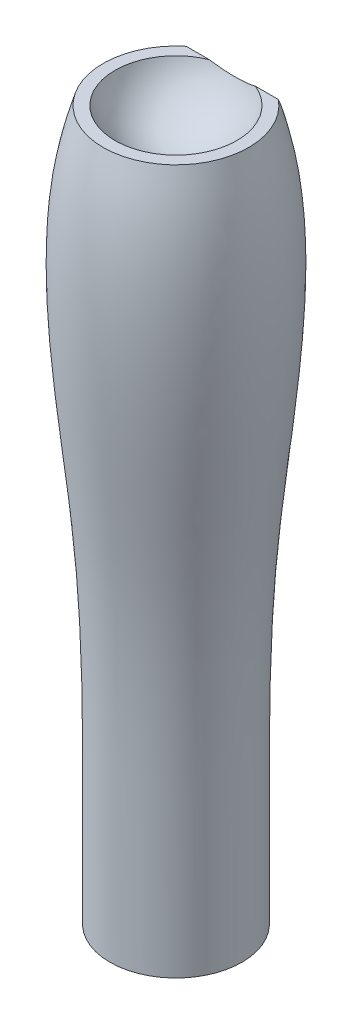
ISO-10303-21;
HEADER;
FILE_DESCRIPTION(('STEP AP214'),'2;1');
FILE_NAME('part.step','',(''),(''),'','','');
FILE_SCHEMA(('AUTOMOTIVE_DESIGN { 1 0 10303 214 1 1 1 1 }'));
ENDSEC;
DATA;
#1=APPLICATION_CONTEXT('core data for automotive mechanical design processes');
#2=APPLICATION_PROTOCOL_DEFINITION('international standard','automotive_design',2000,#1);
#3=PRODUCT_CONTEXT('',#1,'mechanical');
#4=PRODUCT('Part','Part','',(#3));
#5=PRODUCT_RELATED_PRODUCT_CATEGORY('part','',(#4));
#6=PRODUCT_DEFINITION_FORMATION('','',#4);
#7=PRODUCT_DEFINITION_CONTEXT('part definition',#1,'design');
#8=PRODUCT_DEFINITION('design','',#6,#7);
#9=PRODUCT_DEFINITION_SHAPE('','',#8);
#10=(LENGTH_UNIT() NAMED_UNIT(*) SI_UNIT(.MILLI.,.METRE.));
#11=(NAMED_UNIT(*) PLANE_ANGLE_UNIT() SI_UNIT($,.RADIAN.));
#12=(NAMED_UNIT(*) SI_UNIT($,.STERADIAN.) SOLID_ANGLE_UNIT());
#13=UNCERTAINTY_MEASURE_WITH_UNIT(LENGTH_MEASURE(1.E-05),#10,'distance_accuracy_value','');
#14=(GEOMETRIC_REPRESENTATION_CONTEXT(3) GLOBAL_UNCERTAINTY_ASSIGNED_CONTEXT((#13)) GLOBAL_UNIT_ASSIGNED_CONTEXT((#10,
#11,#12)) REPRESENTATION_CONTEXT('',''));
#15=CARTESIAN_POINT('',(0.,0.,0.));
#16=DIRECTION('',(0.,0.,1.));
#17=DIRECTION('',(1.,0.,0.));
#18=AXIS2_PLACEMENT_3D('',#15,#16,#17);
#19=CARTESIAN_POINT('',(-0.000457822219530569,-203.890571265797,-0.0541182311176803));
#20=DIRECTION('',(0.,1.,0.));
#21=DIRECTION('',(0.,0.,1.));
#22=AXIS2_PLACEMENT_3D('',#19,#20,#21);
#23=PLANE('',#22);
#24=CARTESIAN_POINT('',(-0.000457822219609983,-203.890571265797,-0.0541182311176803));
#25=DIRECTION('',(0.,1.,0.));
#26=DIRECTION('',(0.,0.,1.));
#27=AXIS2_PLACEMENT_3D('',#24,#25,#26);
#28=CIRCLE('',#27,34.6786200000001);
#29=CARTESIAN_POINT('',(-0.000457822219609983,-203.890571265797,34.6245017688824));
#30=VERTEX_POINT('',#29);
#31=EDGE_CURVE('E44',#30,#30,#28,.T.);
#32=ORIENTED_EDGE('',*,*,#31,.F.);
#33=EDGE_LOOP('',(#32));
#34=FACE_BOUND('',#33,.T.);
#35=CARTESIAN_POINT('',(-0.000457822219609983,-203.890571265797,-0.0541182311176803));
#36=DIRECTION('',(0.,1.,0.));
#37=DIRECTION('',(0.,0.,1.));
#38=AXIS2_PLACEMENT_3D('',#35,#36,#37);
#39=CIRCLE('',#38,23.5732021835537);
#40=CARTESIAN_POINT('',(-0.000457822219609983,-203.890571265797,23.519083952436));
#41=VERTEX_POINT('',#40);
#42=EDGE_CURVE('E73',#41,#41,#39,.F.);
#43=ORIENTED_EDGE('',*,*,#42,.F.);
#44=EDGE_LOOP('',(#43));
#45=FACE_BOUND('',#44,.T.);
#46=ADVANCED_FACE('F36',(#34,#45),#23,.F.);
#47=CARTESIAN_POINT('',(-0.000457822219644463,168.129258734203,-0.0541182311176803));
#48=DIRECTION('',(0.,-1.,0.));
#49=DIRECTION('',(0.,0.,-1.));
#50=AXIS2_PLACEMENT_3D('',#47,#48,#49);
#51=PLANE('',#50);
#52=CARTESIAN_POINT('',(-0.000457822219609983,168.129258734203,-0.0541182311176803));
#53=DIRECTION('',(0.,1.,0.));
#54=DIRECTION('',(0.,0.,1.));
#55=AXIS2_PLACEMENT_3D('',#52,#53,#54);
#56=CIRCLE('',#55,38.20287);
#57=CARTESIAN_POINT('',(-24.1807692985127,168.129258734203,-29.6306598333123));
#58=VERTEX_POINT('',#57);
#59=CARTESIAN_POINT('',(24.1798536540734,168.129258734203,-29.6306598333123));
#60=VERTEX_POINT('',#59);
#61=EDGE_CURVE('E70',#58,#60,#56,.T.);
#62=ORIENTED_EDGE('',*,*,#61,.T.);
#63=DIRECTION('',(-1.,0.,0.));
#64=VECTOR('',#63,1.);
#65=CARTESIAN_POINT('',(-0.000457822219644463,168.129258734203,-29.6306598333123));
#66=LINE('',#65,#64);
#67=CARTESIAN_POINT('',(12.0820178478315,168.129258734203,-29.6306598333123));
#68=VERTEX_POINT('',#67);
#69=EDGE_CURVE('E63',#60,#68,#66,.T.);
#70=ORIENTED_EDGE('',*,*,#69,.T.);
#71=CARTESIAN_POINT('',(-0.000457822219609983,168.129258734203,-0.0541182311176803));
#72=DIRECTION('',(0.,-1.,0.));
#73=DIRECTION('',(0.,0.,-1.));
#74=AXIS2_PLACEMENT_3D('',#71,#72,#73);
#75=CIRCLE('',#74,31.9493040841851);
#76=CARTESIAN_POINT('',(-12.0829334922707,168.129258734203,-29.6306598333123));
#77=VERTEX_POINT('',#76);
#78=EDGE_CURVE('E69',#68,#77,#75,.T.);
#79=ORIENTED_EDGE('',*,*,#78,.T.);
#80=EDGE_CURVE('E51',#77,#58,#66,.T.);
#81=ORIENTED_EDGE('',*,*,#80,.T.);
#82=EDGE_LOOP('',(#62,#70,#79,#81));
#83=FACE_BOUND('',#82,.T.);
#84=ADVANCED_FACE('F38',(#83),#51,.F.);
#85=CARTESIAN_POINT('',(34.6781621777804,-203.890571265797,-0.0541182311176803));
#86=CARTESIAN_POINT('',(34.6868419437602,-189.331607189585,-0.0541182311176803));
#87=CARTESIAN_POINT('',(34.7204524038073,-132.955262303004,-0.0541182311176803));
#88=CARTESIAN_POINT('',(34.0928513120584,-33.5241357545708,-0.0541182311176803));
#89=CARTESIAN_POINT('',(51.0427266953173,69.9885933086475,-0.0541182311176803));
#90=CARTESIAN_POINT('',(46.7362092204269,138.770266329847,-0.0541182311176803));
#91=CARTESIAN_POINT('',(39.6785828310382,163.050759353453,-0.0541182311176803));
#92=CARTESIAN_POINT('',(38.2024121777804,168.129258734203,-0.0541182311176803));
#93=B_SPLINE_CURVE_WITH_KNOTS('',3,(#85,#86,#87,#88,#89,#90,#91,#92),.UNSPECIFIED.,.F.,.F.,(4,1,
1,1,1,4),(0.,0.117019905107038,0.453133512410299,0.796967268231894,0.95753374523516,1.),.UNSPECIFIED.);
#94=CARTESIAN_POINT('',(-0.000457822219609983,227.669315563425,-0.0541182311176803));
#95=DIRECTION('',(0.,1.,0.));
#96=AXIS1_PLACEMENT('',#94,#95);
#97=SURFACE_OF_REVOLUTION('',#93,#96);
#98=ORIENTED_EDGE('',*,*,#61,.F.);
#99=CARTESIAN_POINT('',(-24.1807692985127,168.129258734203,-29.6306598333123));
#100=CARTESIAN_POINT('',(-24.066371414641,167.661209329227,-29.899903168209));
#101=CARTESIAN_POINT('',(-23.9480134935902,167.193873360717,-30.1687361019576));
#102=CARTESIAN_POINT('',(-23.7024428492952,166.260906493951,-30.705421135387));
#103=CARTESIAN_POINT('',(-23.5752292512996,165.795275768933,-30.9732731354141));
#104=CARTESIAN_POINT('',(-23.3099602628212,164.862311137304,-31.5099568830912));
#105=CARTESIAN_POINT('',(-23.1718250985307,164.394994186308,-31.7787788770993));
#106=CARTESIAN_POINT('',(-22.8846028177429,163.462913949607,-32.314953880534));
#107=CARTESIAN_POINT('',(-22.7355159771983,162.998150599876,-32.582306926792));
#108=CARTESIAN_POINT('',(-22.2692712372194,161.605584863031,-33.3833741625688));
#109=CARTESIAN_POINT('',(-21.9339041329071,160.682283183747,-33.914499339961));
#110=CARTESIAN_POINT('',(-21.1989443726338,158.837287362502,-34.9758249660627));
#111=CARTESIAN_POINT('',(-20.798361060497,157.915884730696,-35.5058577248543));
#112=CARTESIAN_POINT('',(-20.1447682876093,156.554202254228,-36.2891595026942));
#113=CARTESIAN_POINT('',(-19.9184303409615,156.104256013136,-36.5479890732226));
#114=CARTESIAN_POINT('',(-19.4465863184296,155.211924079373,-37.0612990424844));
#115=CARTESIAN_POINT('',(-19.2010796453724,154.769538622771,-37.3157793054203));
#116=CARTESIAN_POINT('',(-18.6899450599347,153.894619108348,-37.8190728580347));
#117=CARTESIAN_POINT('',(-18.4243559979293,153.462068033292,-38.0678959368017));
#118=CARTESIAN_POINT('',(-17.8711793184412,152.607689235522,-38.5593735336775));
#119=CARTESIAN_POINT('',(-17.5835946594572,152.185860080799,-38.8020288755431));
#120=CARTESIAN_POINT('',(-17.1227261709445,151.54531292974,-39.1705007703391));
#121=CARTESIAN_POINT('',(-16.9575348359349,151.322198884704,-39.298846130699));
#122=CARTESIAN_POINT('',(-16.6203165116219,150.879900880296,-39.5532760871502));
#123=CARTESIAN_POINT('',(-16.4482897769824,150.660716774948,-39.6793607672132));
#124=CARTESIAN_POINT('',(-15.9216493875079,150.009405547009,-40.0540246492774));
#125=CARTESIAN_POINT('',(-15.556528851879,149.583593929589,-40.2989708850662));
#126=CARTESIAN_POINT('',(-14.7981884624142,148.752758028904,-40.7769055352847));
#127=CARTESIAN_POINT('',(-14.4050348046605,148.347688417461,-41.009920024548));
#128=CARTESIAN_POINT('',(-13.5889777255231,147.560678357578,-41.4626440551043));
#129=CARTESIAN_POINT('',(-13.1660762781235,147.178736377574,-41.6823544774229));
#130=CARTESIAN_POINT('',(-12.2850440132406,146.437897401389,-42.1085187977897));
#131=CARTESIAN_POINT('',(-11.8265782829289,146.079298372049,-42.3148012917393));
#132=CARTESIAN_POINT('',(-10.8782634548096,145.394504212515,-42.7087260810256));
#133=CARTESIAN_POINT('',(-10.3884111536051,145.068312398581,-42.8963664686986));
#134=CARTESIAN_POINT('',(-9.37841349545897,144.454115726507,-43.2496803678584));
#135=CARTESIAN_POINT('',(-8.85829914892526,144.166072734601,-43.4153758156256));
#136=CARTESIAN_POINT('',(-7.78904873062155,143.633807709995,-43.7215588996123));
#137=CARTESIAN_POINT('',(-7.23992391944241,143.389568833907,-43.8620562249163));
#138=CARTESIAN_POINT('',(-6.26135764587606,143.00779315784,-44.0816709816364));
#139=CARTESIAN_POINT('',(-5.83773311124107,142.859001794565,-44.1672625504453));
#140=CARTESIAN_POINT('',(-4.97812011205597,142.591212876559,-44.3213069324402));
#141=CARTESIAN_POINT('',(-4.54213343713646,142.472211033554,-44.3897622124359));
#142=CARTESIAN_POINT('',(-3.66049914289525,142.26622116495,-44.5082569665966));
#143=CARTESIAN_POINT('',(-3.21485845647018,142.179210922576,-44.5583092208627));
#144=CARTESIAN_POINT('',(-2.31654178856882,142.038807225215,-44.6390758222246));
#145=CARTESIAN_POINT('',(-1.86386566888576,141.98541443148,-44.6697897889382));
#146=CARTESIAN_POINT('',(-0.953287549085808,141.91325553562,-44.7112988722899));
#147=CARTESIAN_POINT('',(-0.495373026490888,141.894607576778,-44.7220260275309));
#148=CARTESIAN_POINT('',(0.420553498707558,141.892707197216,-44.723119212407));
#149=CARTESIAN_POINT('',(0.87856550115645,141.90945472076,-44.7134852741041));
#150=CARTESIAN_POINT('',(1.79114730636866,141.977981764513,-44.674065397496));
#151=CARTESIAN_POINT('',(2.24571652409704,142.029767109402,-44.6442761085692));
#152=CARTESIAN_POINT('',(3.14794479924903,142.167273292509,-44.5651762893726));
#153=CARTESIAN_POINT('',(3.5956038559254,142.252994134397,-44.5158657569919));
#154=CARTESIAN_POINT('',(4.4624728743888,142.452383381615,-44.4011679808749));
#155=CARTESIAN_POINT('',(4.88208937949853,142.564732004574,-44.3365399360679));
#156=CARTESIAN_POINT('',(5.71003435979599,142.817100249478,-44.1913662275716));
#157=CARTESIAN_POINT('',(6.11836347480837,142.957118299301,-44.1108214682376));
#158=CARTESIAN_POINT('',(6.922185573454,143.262762040185,-43.9350012680388));
#159=CARTESIAN_POINT('',(7.31767383403758,143.428397027263,-43.8397204796808));
#160=CARTESIAN_POINT('',(8.09451120082559,143.783071268103,-43.6356957028296));
#161=CARTESIAN_POINT('',(8.4758570946969,143.972115797365,-43.5269486796276));
#162=CARTESIAN_POINT('',(9.12730212848297,144.320015965565,-43.3268206578817));
#163=CARTESIAN_POINT('',(9.4007925789701,144.474134790866,-43.2381644902779));
#164=CARTESIAN_POINT('',(9.93918167443991,144.793147187077,-43.0546540306637));
#165=CARTESIAN_POINT('',(10.2040818869751,144.958038775421,-42.9598008791155));
#166=CARTESIAN_POINT('',(10.9859765554054,145.467807983159,-42.6665584135555));
#167=CARTESIAN_POINT('',(11.4900419744611,145.827713657165,-42.4595242780829));
#168=CARTESIAN_POINT('',(12.4636639775329,146.581693751585,-42.0258005879997));
#169=CARTESIAN_POINT('',(12.9331797648607,146.975807405826,-41.7990884643048));
#170=CARTESIAN_POINT('',(13.8377051966949,147.792614150589,-41.3292240235257));
#171=CARTESIAN_POINT('',(14.2727142753444,148.215307709566,-41.0860714369644));
#172=CARTESIAN_POINT('',(15.3148306960773,149.298506183114,-40.4629663410652));
#173=CARTESIAN_POINT('',(15.9014966229094,149.973824959478,-40.0744922237311));
#174=CARTESIAN_POINT('',(17.004613144779,151.366273637091,-39.2734923257557));
#175=CARTESIAN_POINT('',(17.5210311189049,152.083422743655,-38.8609554973428));
#176=CARTESIAN_POINT('',(18.4898992225389,153.553428264905,-38.015341370607));
#177=CARTESIAN_POINT('',(18.9420598449634,154.306427070606,-37.5821821624873));
#178=CARTESIAN_POINT('',(19.7873397079617,155.836942505792,-36.7017599773512));
#179=CARTESIAN_POINT('',(20.1804437409898,156.61446538827,-36.2544934033283));
#180=CARTESIAN_POINT('',(20.8189865737344,157.981912057299,-35.4678757993988));
#181=CARTESIAN_POINT('',(21.0761704281477,158.567769401531,-35.1308639723188));
#182=CARTESIAN_POINT('',(21.5652548464477,159.747408862724,-34.4522816279537));
#183=CARTESIAN_POINT('',(21.7971529534786,160.341191743479,-34.1107106712995));
#184=CARTESIAN_POINT('',(22.2384218803719,161.535183937915,-33.4238719810823));
#185=CARTESIAN_POINT('',(22.4477856000626,162.13539521195,-33.0786031198344));
#186=CARTESIAN_POINT('',(22.8434236273331,163.331651749367,-32.3904618764053));
#187=CARTESIAN_POINT('',(23.0299997127572,163.927622343266,-32.0476324475122));
#188=CARTESIAN_POINT('',(23.3858772179044,165.123159931047,-31.3599047766583));
#189=CARTESIAN_POINT('',(23.555185232277,165.72272545871,-31.0150073781343));
#190=CARTESIAN_POINT('',(23.878451875794,166.924229817776,-30.3238473486825));
#191=CARTESIAN_POINT('',(24.0324281172532,167.526165080599,-29.9775867705654));
#192=CARTESIAN_POINT('',(24.1798536540734,168.129258734203,-29.6306598333123));
#193=B_SPLINE_CURVE_WITH_KNOTS('',3,(#99,#100,#101,#102,#103,#104,#105,#106,#107,#108,#109,#110,
#111,#112,#113,#114,#115,#116,#117,#118,#119,#120,#121,#122,#123,#124,#125,#126,#127,#128,#129,
#130,#131,#132,#133,#134,#135,#136,#137,#138,#139,#140,#141,#142,#143,#144,#145,#146,#147,#148,
#149,#150,#151,#152,#153,#154,#155,#156,#157,#158,#159,#160,#161,#162,#163,#164,#165,#166,#167,
#168,#169,#170,#171,#172,#173,#174,#175,#176,#177,#178,#179,#180,#181,#182,#183,#184,#185,#186,
#187,#188,#189,#190,#191,#192),.UNSPECIFIED.,.F.,.F.,(4,2,2,2,2,2,2,2,2,2,2,2,2,2,2,2,2,2,2,2,2,
2,2,2,2,2,2,2,2,2,2,2,2,2,2,2,2,2,2,2,2,2,2,2,2,2,4),(0.,1.65585823523155,3.31188026654646,
4.98137301688825,6.6508237149215,9.99960295438053,13.4050416945359,15.1035615942725,
16.8021344299815,18.4975014612351,20.1926408582742,21.1100743182434,22.0274736297227,
23.862575006192,25.6934780740612,27.5242597624801,29.3750785117619,31.2260864623478,
33.0752299409947,34.9236608625804,36.2935830417034,37.6633079037112,39.0320797466499,
40.4008785123404,41.7743231863147,43.1477656975772,44.5214365857715,45.8951076225089,
47.2112888277612,48.5273952717734,49.8439804373991,51.1608628463763,52.1391265244655,
53.1172106721375,55.0738122300425,57.0326882807985,58.9915964474593,61.9128600026525,
64.8354755021727,67.7708673389783,70.707013771837,72.8759636698135,75.0451241234517,
77.2149660512226,79.3519313835617,81.48807753206,83.621740773707),.UNSPECIFIED.);
#194=EDGE_CURVE('E56',#58,#60,#193,.T.);
#195=ORIENTED_EDGE('',*,*,#194,.T.);
#196=EDGE_LOOP('',(#98,#195));
#197=FACE_BOUND('',#196,.T.);
#198=ORIENTED_EDGE('',*,*,#31,.T.);
#199=EDGE_LOOP('',(#198));
#200=FACE_BOUND('',#199,.T.);
#201=ADVANCED_FACE('F92',(#197,#200),#97,.T.);
#202=CARTESIAN_POINT('',(-0.000457822219609983,178.138128734203,-0.0541182311176803));
#203=DIRECTION('',(0.,-1.,0.));
#204=DIRECTION('',(-1.,0.,0.));
#205=AXIS2_PLACEMENT_3D('',#202,#203,#204);
#206=SPHERICAL_SURFACE('',#205,33.480375);
#207=ORIENTED_EDGE('',*,*,#78,.F.);
#208=CARTESIAN_POINT('',(-0.000457822219609983,188.433182988436,-17.9509178667956));
#209=DIRECTION('',(0.,-0.498631071908065,0.866814313522691));
#210=DIRECTION('',(0.,-0.866814313522691,-0.498631071908065));
#211=AXIS2_PLACEMENT_3D('',#208,#209,#210);
#212=CIRCLE('',#211,26.356250318348);
#213=EDGE_CURVE('E11',#68,#77,#212,.F.);
#214=ORIENTED_EDGE('',*,*,#213,.T.);
#215=EDGE_LOOP('',(#207,#214));
#216=FACE_BOUND('',#215,.T.);
#217=ADVANCED_FACE('F72',(#216),#206,.F.);
#218=CARTESIAN_POINT('',(-0.000457822219609983,-212.489741265797,-0.0541182311176803));
#219=DIRECTION('',(0.,1.,0.));
#220=DIRECTION('',(1.,0.,0.));
#221=AXIS2_PLACEMENT_3D('',#218,#219,#220);
#222=SPHERICAL_SURFACE('',#221,25.09266);
#223=ORIENTED_EDGE('',*,*,#42,.T.);
#224=EDGE_LOOP('',(#223));
#225=FACE_BOUND('',#224,.T.);
#226=ADVANCED_FACE('F106',(#225),#222,.F.);
#227=CARTESIAN_POINT('',(-122.519986835924,168.32549405097,-29.5177763416357));
#228=DIRECTION('',(0.,-0.498631071908065,0.866814313522691));
#229=DIRECTION('',(0.,-0.866814313522691,-0.498631071908065));
#230=AXIS2_PLACEMENT_3D('',#227,#228,#229);
#231=PLANE('',#230);
#232=ORIENTED_EDGE('',*,*,#80,.F.);
#233=ORIENTED_EDGE('',*,*,#213,.F.);
#234=ORIENTED_EDGE('',*,*,#69,.F.);
#235=ORIENTED_EDGE('',*,*,#194,.F.);
#236=EDGE_LOOP('',(#232,#233,#234,#235));
#237=FACE_BOUND('',#236,.T.);
#238=ADVANCED_FACE('F62',(#237),#231,.F.);
#239=CLOSED_SHELL('',(#46,#84,#201,#217,#226,#238));
#240=MANIFOLD_SOLID_BREP('B2',#239);
#241=ADVANCED_BREP_SHAPE_REPRESENTATION('',(#18,#240),#14);
#242=SHAPE_DEFINITION_REPRESENTATION(#9,#241);
ENDSEC;
END-ISO-10303-21;
